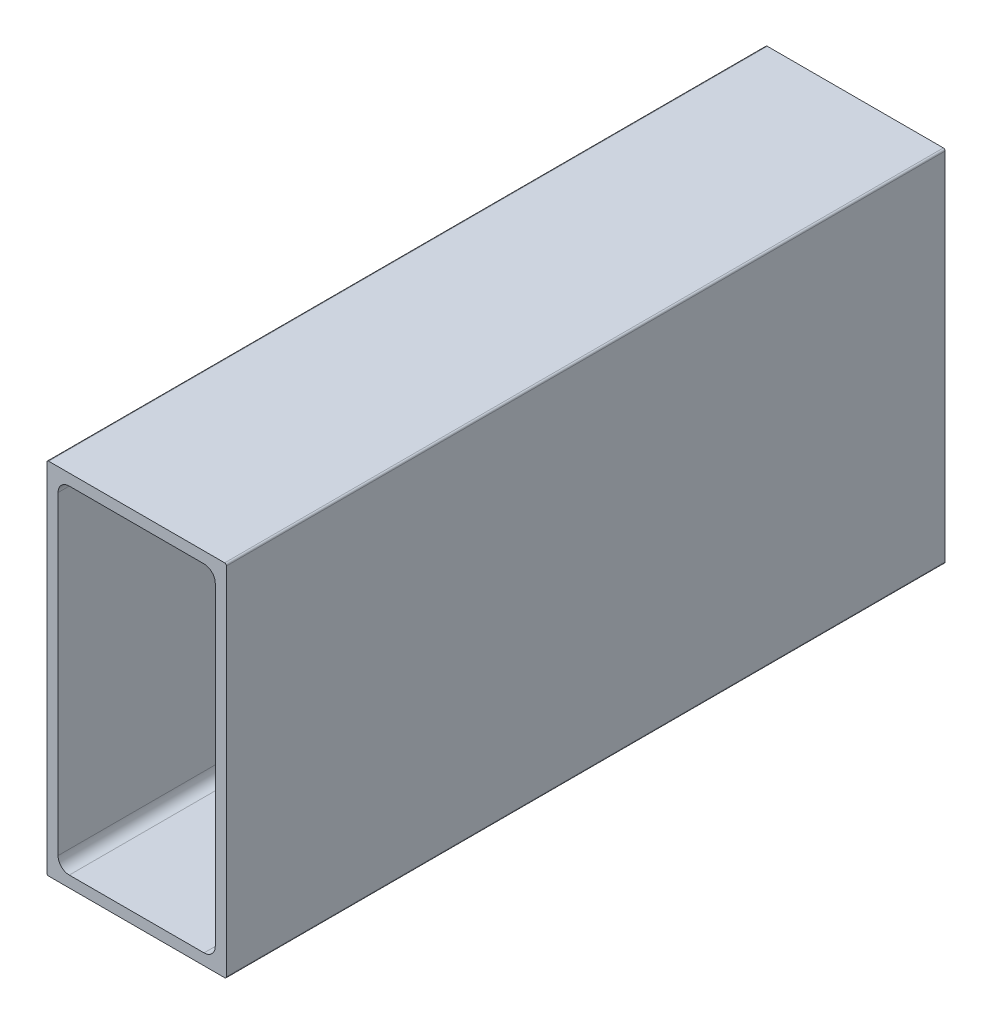
ISO-10303-21;
HEADER;
FILE_DESCRIPTION(('STEP AP214'),'2;1');
FILE_NAME('part.step','',(''),(''),'','','');
FILE_SCHEMA(('AUTOMOTIVE_DESIGN { 1 0 10303 214 1 1 1 1 }'));
ENDSEC;
DATA;
#1=APPLICATION_CONTEXT('core data for automotive mechanical design processes');
#2=APPLICATION_PROTOCOL_DEFINITION('international standard','automotive_design',2000,#1);
#3=PRODUCT_CONTEXT('',#1,'mechanical');
#4=PRODUCT('Part','Part','',(#3));
#5=PRODUCT_RELATED_PRODUCT_CATEGORY('part','',(#4));
#6=PRODUCT_DEFINITION_FORMATION('','',#4);
#7=PRODUCT_DEFINITION_CONTEXT('part definition',#1,'design');
#8=PRODUCT_DEFINITION('design','',#6,#7);
#9=PRODUCT_DEFINITION_SHAPE('','',#8);
#10=(LENGTH_UNIT() NAMED_UNIT(*) SI_UNIT(.MILLI.,.METRE.));
#11=(NAMED_UNIT(*) PLANE_ANGLE_UNIT() SI_UNIT($,.RADIAN.));
#12=(NAMED_UNIT(*) SI_UNIT($,.STERADIAN.) SOLID_ANGLE_UNIT());
#13=UNCERTAINTY_MEASURE_WITH_UNIT(LENGTH_MEASURE(1.E-05),#10,'distance_accuracy_value','');
#14=(GEOMETRIC_REPRESENTATION_CONTEXT(3) GLOBAL_UNCERTAINTY_ASSIGNED_CONTEXT((#13)) GLOBAL_UNIT_ASSIGNED_CONTEXT((#10,
#11,#12)) REPRESENTATION_CONTEXT('',''));
#15=CARTESIAN_POINT('',(0.,0.,0.));
#16=DIRECTION('',(0.,0.,1.));
#17=DIRECTION('',(1.,0.,0.));
#18=AXIS2_PLACEMENT_3D('',#15,#16,#17);
#19=CARTESIAN_POINT('',(12.446,25.146,101.6));
#20=DIRECTION('',(0.,0.,-1.));
#21=DIRECTION('',(-1.,0.,0.));
#22=AXIS2_PLACEMENT_3D('',#19,#20,#21);
#23=CYLINDRICAL_SURFACE('',#22,0.253999999999998);
#24=CARTESIAN_POINT('',(12.446,25.146,0.));
#25=DIRECTION('',(0.,0.,-1.));
#26=DIRECTION('',(-1.,0.,0.));
#27=AXIS2_PLACEMENT_3D('',#24,#25,#26);
#28=CIRCLE('',#27,0.253999999999998);
#29=CARTESIAN_POINT('',(12.446,25.4,0.));
#30=VERTEX_POINT('',#29);
#31=CARTESIAN_POINT('',(12.7,25.146,0.));
#32=VERTEX_POINT('',#31);
#33=EDGE_CURVE('E228',#30,#32,#28,.T.);
#34=ORIENTED_EDGE('',*,*,#33,.F.);
#35=DIRECTION('',(0.,0.,-1.));
#36=VECTOR('',#35,1.);
#37=CARTESIAN_POINT('',(12.446,25.4,101.6));
#38=LINE('',#37,#36);
#39=CARTESIAN_POINT('',(12.446,25.4,101.6));
#40=VERTEX_POINT('',#39);
#41=EDGE_CURVE('E11',#40,#30,#38,.T.);
#42=ORIENTED_EDGE('',*,*,#41,.F.);
#43=CARTESIAN_POINT('',(12.446,25.146,101.6));
#44=DIRECTION('',(0.,0.,-1.));
#45=DIRECTION('',(-1.,0.,0.));
#46=AXIS2_PLACEMENT_3D('',#43,#44,#45);
#47=CIRCLE('',#46,0.253999999999998);
#48=CARTESIAN_POINT('',(12.7,25.146,101.6));
#49=VERTEX_POINT('',#48);
#50=EDGE_CURVE('E246',#40,#49,#47,.T.);
#51=ORIENTED_EDGE('',*,*,#50,.T.);
#52=DIRECTION('',(0.,0.,-1.));
#53=VECTOR('',#52,1.);
#54=CARTESIAN_POINT('',(12.7,25.146,101.6));
#55=LINE('',#54,#53);
#56=EDGE_CURVE('E42',#49,#32,#55,.T.);
#57=ORIENTED_EDGE('',*,*,#56,.T.);
#58=EDGE_LOOP('',(#34,#42,#51,#57));
#59=FACE_BOUND('',#58,.T.);
#60=ADVANCED_FACE('F39',(#59),#23,.T.);
#61=CARTESIAN_POINT('',(-12.446,25.4,101.6));
#62=DIRECTION('',(0.,1.,0.));
#63=DIRECTION('',(0.,0.,1.));
#64=AXIS2_PLACEMENT_3D('',#61,#62,#63);
#65=PLANE('',#64);
#66=DIRECTION('',(1.,0.,0.));
#67=VECTOR('',#66,1.);
#68=CARTESIAN_POINT('',(-12.446,25.4,0.));
#69=LINE('',#68,#67);
#70=CARTESIAN_POINT('',(-12.446,25.4,0.));
#71=VERTEX_POINT('',#70);
#72=EDGE_CURVE('E251',#71,#30,#69,.T.);
#73=ORIENTED_EDGE('',*,*,#72,.F.);
#74=DIRECTION('',(0.,0.,-1.));
#75=VECTOR('',#74,1.);
#76=CARTESIAN_POINT('',(-12.446,25.4,101.6));
#77=LINE('',#76,#75);
#78=CARTESIAN_POINT('',(-12.446,25.4,101.6));
#79=VERTEX_POINT('',#78);
#80=EDGE_CURVE('E48',#79,#71,#77,.T.);
#81=ORIENTED_EDGE('',*,*,#80,.F.);
#82=DIRECTION('',(1.,0.,0.));
#83=VECTOR('',#82,1.);
#84=CARTESIAN_POINT('',(-12.446,25.4,101.6));
#85=LINE('',#84,#83);
#86=EDGE_CURVE('E275',#79,#40,#85,.T.);
#87=ORIENTED_EDGE('',*,*,#86,.T.);
#88=ORIENTED_EDGE('',*,*,#41,.T.);
#89=EDGE_LOOP('',(#73,#81,#87,#88));
#90=FACE_BOUND('',#89,.T.);
#91=ADVANCED_FACE('F338',(#90),#65,.T.);
#92=CARTESIAN_POINT('',(-12.446,25.146,101.6));
#93=DIRECTION('',(0.,0.,-1.));
#94=DIRECTION('',(-1.,0.,0.));
#95=AXIS2_PLACEMENT_3D('',#92,#93,#94);
#96=CYLINDRICAL_SURFACE('',#95,0.253999999999998);
#97=CARTESIAN_POINT('',(-12.446,25.146,0.));
#98=DIRECTION('',(0.,0.,-1.));
#99=DIRECTION('',(-1.,0.,0.));
#100=AXIS2_PLACEMENT_3D('',#97,#98,#99);
#101=CIRCLE('',#100,0.253999999999998);
#102=CARTESIAN_POINT('',(-12.7,25.146,0.));
#103=VERTEX_POINT('',#102);
#104=EDGE_CURVE('E302',#103,#71,#101,.T.);
#105=ORIENTED_EDGE('',*,*,#104,.F.);
#106=DIRECTION('',(0.,0.,-1.));
#107=VECTOR('',#106,1.);
#108=CARTESIAN_POINT('',(-12.7,25.146,101.6));
#109=LINE('',#108,#107);
#110=CARTESIAN_POINT('',(-12.7,25.146,101.6));
#111=VERTEX_POINT('',#110);
#112=EDGE_CURVE('E311',#111,#103,#109,.T.);
#113=ORIENTED_EDGE('',*,*,#112,.F.);
#114=CARTESIAN_POINT('',(-12.446,25.146,101.6));
#115=DIRECTION('',(0.,0.,-1.));
#116=DIRECTION('',(-1.,0.,0.));
#117=AXIS2_PLACEMENT_3D('',#114,#115,#116);
#118=CIRCLE('',#117,0.253999999999998);
#119=EDGE_CURVE('E271',#111,#79,#118,.T.);
#120=ORIENTED_EDGE('',*,*,#119,.T.);
#121=ORIENTED_EDGE('',*,*,#80,.T.);
#122=EDGE_LOOP('',(#105,#113,#120,#121));
#123=FACE_BOUND('',#122,.T.);
#124=ADVANCED_FACE('F357',(#123),#96,.T.);
#125=CARTESIAN_POINT('',(-12.7,-25.146,101.6));
#126=DIRECTION('',(-1.,0.,0.));
#127=DIRECTION('',(0.,0.,1.));
#128=AXIS2_PLACEMENT_3D('',#125,#126,#127);
#129=PLANE('',#128);
#130=DIRECTION('',(0.,1.,0.));
#131=VECTOR('',#130,1.);
#132=CARTESIAN_POINT('',(-12.7,-25.146,0.));
#133=LINE('',#132,#131);
#134=CARTESIAN_POINT('',(-12.7,-25.146,0.));
#135=VERTEX_POINT('',#134);
#136=EDGE_CURVE('E298',#135,#103,#133,.T.);
#137=ORIENTED_EDGE('',*,*,#136,.F.);
#138=DIRECTION('',(0.,0.,-1.));
#139=VECTOR('',#138,1.);
#140=CARTESIAN_POINT('',(-12.7,-25.146,101.6));
#141=LINE('',#140,#139);
#142=CARTESIAN_POINT('',(-12.7,-25.146,101.6));
#143=VERTEX_POINT('',#142);
#144=EDGE_CURVE('E314',#143,#135,#141,.T.);
#145=ORIENTED_EDGE('',*,*,#144,.F.);
#146=DIRECTION('',(0.,1.,0.));
#147=VECTOR('',#146,1.);
#148=CARTESIAN_POINT('',(-12.7,-25.146,101.6));
#149=LINE('',#148,#147);
#150=EDGE_CURVE('E267',#143,#111,#149,.T.);
#151=ORIENTED_EDGE('',*,*,#150,.T.);
#152=ORIENTED_EDGE('',*,*,#112,.T.);
#153=EDGE_LOOP('',(#137,#145,#151,#152));
#154=FACE_BOUND('',#153,.T.);
#155=ADVANCED_FACE('F355',(#154),#129,.T.);
#156=CARTESIAN_POINT('',(-12.446,-25.146,101.6));
#157=DIRECTION('',(0.,0.,-1.));
#158=DIRECTION('',(-1.,0.,0.));
#159=AXIS2_PLACEMENT_3D('',#156,#157,#158);
#160=CYLINDRICAL_SURFACE('',#159,0.253999999999998);
#161=CARTESIAN_POINT('',(-12.446,-25.146,0.));
#162=DIRECTION('',(0.,0.,-1.));
#163=DIRECTION('',(-1.,0.,0.));
#164=AXIS2_PLACEMENT_3D('',#161,#162,#163);
#165=CIRCLE('',#164,0.253999999999998);
#166=CARTESIAN_POINT('',(-12.446,-25.4,0.));
#167=VERTEX_POINT('',#166);
#168=EDGE_CURVE('E294',#167,#135,#165,.T.);
#169=ORIENTED_EDGE('',*,*,#168,.F.);
#170=DIRECTION('',(0.,0.,-1.));
#171=VECTOR('',#170,1.);
#172=CARTESIAN_POINT('',(-12.446,-25.4,101.6));
#173=LINE('',#172,#171);
#174=CARTESIAN_POINT('',(-12.446,-25.4,101.6));
#175=VERTEX_POINT('',#174);
#176=EDGE_CURVE('E317',#175,#167,#173,.T.);
#177=ORIENTED_EDGE('',*,*,#176,.F.);
#178=CARTESIAN_POINT('',(-12.446,-25.146,101.6));
#179=DIRECTION('',(0.,0.,-1.));
#180=DIRECTION('',(-1.,0.,0.));
#181=AXIS2_PLACEMENT_3D('',#178,#179,#180);
#182=CIRCLE('',#181,0.253999999999998);
#183=EDGE_CURVE('E263',#175,#143,#182,.T.);
#184=ORIENTED_EDGE('',*,*,#183,.T.);
#185=ORIENTED_EDGE('',*,*,#144,.T.);
#186=EDGE_LOOP('',(#169,#177,#184,#185));
#187=FACE_BOUND('',#186,.T.);
#188=ADVANCED_FACE('F351',(#187),#160,.T.);
#189=CARTESIAN_POINT('',(12.446,-25.4,101.6));
#190=DIRECTION('',(0.,-1.,0.));
#191=DIRECTION('',(0.,0.,-1.));
#192=AXIS2_PLACEMENT_3D('',#189,#190,#191);
#193=PLANE('',#192);
#194=DIRECTION('',(-1.,0.,0.));
#195=VECTOR('',#194,1.);
#196=CARTESIAN_POINT('',(12.446,-25.4,0.));
#197=LINE('',#196,#195);
#198=CARTESIAN_POINT('',(12.446,-25.4,0.));
#199=VERTEX_POINT('',#198);
#200=EDGE_CURVE('E290',#199,#167,#197,.T.);
#201=ORIENTED_EDGE('',*,*,#200,.F.);
#202=DIRECTION('',(0.,0.,-1.));
#203=VECTOR('',#202,1.);
#204=CARTESIAN_POINT('',(12.446,-25.4,101.6));
#205=LINE('',#204,#203);
#206=CARTESIAN_POINT('',(12.446,-25.4,101.6));
#207=VERTEX_POINT('',#206);
#208=EDGE_CURVE('E320',#207,#199,#205,.T.);
#209=ORIENTED_EDGE('',*,*,#208,.F.);
#210=DIRECTION('',(-1.,0.,0.));
#211=VECTOR('',#210,1.);
#212=CARTESIAN_POINT('',(12.446,-25.4,101.6));
#213=LINE('',#212,#211);
#214=EDGE_CURVE('E259',#207,#175,#213,.T.);
#215=ORIENTED_EDGE('',*,*,#214,.T.);
#216=ORIENTED_EDGE('',*,*,#176,.T.);
#217=EDGE_LOOP('',(#201,#209,#215,#216));
#218=FACE_BOUND('',#217,.T.);
#219=ADVANCED_FACE('F349',(#218),#193,.T.);
#220=CARTESIAN_POINT('',(12.446,-25.146,101.6));
#221=DIRECTION('',(0.,0.,-1.));
#222=DIRECTION('',(-1.,0.,0.));
#223=AXIS2_PLACEMENT_3D('',#220,#221,#222);
#224=CYLINDRICAL_SURFACE('',#223,0.253999999999998);
#225=CARTESIAN_POINT('',(12.446,-25.146,0.));
#226=DIRECTION('',(0.,0.,-1.));
#227=DIRECTION('',(-1.,0.,0.));
#228=AXIS2_PLACEMENT_3D('',#225,#226,#227);
#229=CIRCLE('',#228,0.253999999999998);
#230=CARTESIAN_POINT('',(12.7,-25.146,0.));
#231=VERTEX_POINT('',#230);
#232=EDGE_CURVE('E286',#231,#199,#229,.T.);
#233=ORIENTED_EDGE('',*,*,#232,.F.);
#234=DIRECTION('',(0.,0.,-1.));
#235=VECTOR('',#234,1.);
#236=CARTESIAN_POINT('',(12.7,-25.146,101.6));
#237=LINE('',#236,#235);
#238=CARTESIAN_POINT('',(12.7,-25.146,101.6));
#239=VERTEX_POINT('',#238);
#240=EDGE_CURVE('E322',#239,#231,#237,.T.);
#241=ORIENTED_EDGE('',*,*,#240,.F.);
#242=CARTESIAN_POINT('',(12.446,-25.146,101.6));
#243=DIRECTION('',(0.,0.,-1.));
#244=DIRECTION('',(-1.,0.,0.));
#245=AXIS2_PLACEMENT_3D('',#242,#243,#244);
#246=CIRCLE('',#245,0.253999999999998);
#247=EDGE_CURVE('E255',#239,#207,#246,.T.);
#248=ORIENTED_EDGE('',*,*,#247,.T.);
#249=ORIENTED_EDGE('',*,*,#208,.T.);
#250=EDGE_LOOP('',(#233,#241,#248,#249));
#251=FACE_BOUND('',#250,.T.);
#252=ADVANCED_FACE('F345',(#251),#224,.T.);
#253=CARTESIAN_POINT('',(12.7,25.146,101.6));
#254=DIRECTION('',(1.,0.,0.));
#255=DIRECTION('',(0.,0.,-1.));
#256=AXIS2_PLACEMENT_3D('',#253,#254,#255);
#257=PLANE('',#256);
#258=DIRECTION('',(0.,-1.,0.));
#259=VECTOR('',#258,1.);
#260=CARTESIAN_POINT('',(12.7,25.146,0.));
#261=LINE('',#260,#259);
#262=EDGE_CURVE('E282',#32,#231,#261,.T.);
#263=ORIENTED_EDGE('',*,*,#262,.F.);
#264=ORIENTED_EDGE('',*,*,#56,.F.);
#265=DIRECTION('',(0.,-1.,0.));
#266=VECTOR('',#265,1.);
#267=CARTESIAN_POINT('',(12.7,25.146,101.6));
#268=LINE('',#267,#266);
#269=EDGE_CURVE('E250',#49,#239,#268,.T.);
#270=ORIENTED_EDGE('',*,*,#269,.T.);
#271=ORIENTED_EDGE('',*,*,#240,.T.);
#272=EDGE_LOOP('',(#263,#264,#270,#271));
#273=FACE_BOUND('',#272,.T.);
#274=ADVANCED_FACE('F332',(#273),#257,.T.);
#275=CARTESIAN_POINT('',(12.446,25.146,101.6));
#276=DIRECTION('',(0.,0.,-1.));
#277=DIRECTION('',(-1.,0.,0.));
#278=AXIS2_PLACEMENT_3D('',#275,#276,#277);
#279=PLANE('',#278);
#280=DIRECTION('',(0.,-1.,0.));
#281=VECTOR('',#280,1.);
#282=CARTESIAN_POINT('',(11.1125,-22.225,101.6));
#283=LINE('',#282,#281);
#284=CARTESIAN_POINT('',(11.1125,22.225,101.6));
#285=VERTEX_POINT('',#284);
#286=CARTESIAN_POINT('',(11.1125,-22.225,101.6));
#287=VERTEX_POINT('',#286);
#288=EDGE_CURVE('E162',#285,#287,#283,.T.);
#289=ORIENTED_EDGE('',*,*,#288,.T.);
#290=CARTESIAN_POINT('',(9.525,-22.225,101.6));
#291=DIRECTION('',(0.,0.,-1.));
#292=DIRECTION('',(1.,0.,0.));
#293=AXIS2_PLACEMENT_3D('',#290,#291,#292);
#294=CIRCLE('',#293,1.5875);
#295=CARTESIAN_POINT('',(9.525,-23.8125,101.6));
#296=VERTEX_POINT('',#295);
#297=EDGE_CURVE('E155',#287,#296,#294,.T.);
#298=ORIENTED_EDGE('',*,*,#297,.T.);
#299=DIRECTION('',(-1.,0.,0.));
#300=VECTOR('',#299,1.);
#301=CARTESIAN_POINT('',(-9.525,-23.8125,101.6));
#302=LINE('',#301,#300);
#303=CARTESIAN_POINT('',(-9.525,-23.8125,101.6));
#304=VERTEX_POINT('',#303);
#305=EDGE_CURVE('E165',#296,#304,#302,.T.);
#306=ORIENTED_EDGE('',*,*,#305,.T.);
#307=CARTESIAN_POINT('',(-9.525,-22.225,101.6));
#308=DIRECTION('',(0.,0.,-1.));
#309=DIRECTION('',(1.,0.,0.));
#310=AXIS2_PLACEMENT_3D('',#307,#308,#309);
#311=CIRCLE('',#310,1.5875);
#312=CARTESIAN_POINT('',(-11.1125,-22.225,101.6));
#313=VERTEX_POINT('',#312);
#314=EDGE_CURVE('E56',#304,#313,#311,.T.);
#315=ORIENTED_EDGE('',*,*,#314,.T.);
#316=DIRECTION('',(0.,1.,0.));
#317=VECTOR('',#316,1.);
#318=CARTESIAN_POINT('',(-11.1125,22.225,101.6));
#319=LINE('',#318,#317);
#320=CARTESIAN_POINT('',(-11.1125,22.225,101.6));
#321=VERTEX_POINT('',#320);
#322=EDGE_CURVE('E184',#313,#321,#319,.T.);
#323=ORIENTED_EDGE('',*,*,#322,.T.);
#324=CARTESIAN_POINT('',(-9.525,22.225,101.6));
#325=DIRECTION('',(0.,0.,-1.));
#326=DIRECTION('',(1.,0.,0.));
#327=AXIS2_PLACEMENT_3D('',#324,#325,#326);
#328=CIRCLE('',#327,1.5875);
#329=CARTESIAN_POINT('',(-9.525,23.8125,101.6));
#330=VERTEX_POINT('',#329);
#331=EDGE_CURVE('E188',#321,#330,#328,.T.);
#332=ORIENTED_EDGE('',*,*,#331,.T.);
#333=DIRECTION('',(1.,0.,0.));
#334=VECTOR('',#333,1.);
#335=CARTESIAN_POINT('',(9.525,23.8125,101.6));
#336=LINE('',#335,#334);
#337=CARTESIAN_POINT('',(9.525,23.8125,101.6));
#338=VERTEX_POINT('',#337);
#339=EDGE_CURVE('E192',#330,#338,#336,.T.);
#340=ORIENTED_EDGE('',*,*,#339,.T.);
#341=CARTESIAN_POINT('',(9.525,22.225,101.6));
#342=DIRECTION('',(0.,0.,-1.));
#343=DIRECTION('',(1.,0.,0.));
#344=AXIS2_PLACEMENT_3D('',#341,#342,#343);
#345=CIRCLE('',#344,1.5875);
#346=EDGE_CURVE('E196',#338,#285,#345,.T.);
#347=ORIENTED_EDGE('',*,*,#346,.T.);
#348=EDGE_LOOP('',(#289,#298,#306,#315,#323,#332,#340,#347));
#349=FACE_BOUND('',#348,.T.);
#350=ORIENTED_EDGE('',*,*,#50,.F.);
#351=ORIENTED_EDGE('',*,*,#86,.F.);
#352=ORIENTED_EDGE('',*,*,#119,.F.);
#353=ORIENTED_EDGE('',*,*,#150,.F.);
#354=ORIENTED_EDGE('',*,*,#183,.F.);
#355=ORIENTED_EDGE('',*,*,#214,.F.);
#356=ORIENTED_EDGE('',*,*,#247,.F.);
#357=ORIENTED_EDGE('',*,*,#269,.F.);
#358=EDGE_LOOP('',(#350,#351,#352,#353,#354,#355,#356,#357));
#359=FACE_BOUND('',#358,.T.);
#360=ADVANCED_FACE('F170',(#349,#359),#279,.F.);
#361=CARTESIAN_POINT('',(12.446,25.146,0.));
#362=DIRECTION('',(0.,0.,-1.));
#363=DIRECTION('',(-1.,0.,0.));
#364=AXIS2_PLACEMENT_3D('',#361,#362,#363);
#365=PLANE('',#364);
#366=CARTESIAN_POINT('',(9.525,-22.225,0.));
#367=DIRECTION('',(0.,0.,-1.));
#368=DIRECTION('',(1.,0.,0.));
#369=AXIS2_PLACEMENT_3D('',#366,#367,#368);
#370=CIRCLE('',#369,1.5875);
#371=CARTESIAN_POINT('',(11.1125,-22.225,0.));
#372=VERTEX_POINT('',#371);
#373=CARTESIAN_POINT('',(9.525,-23.8125,0.));
#374=VERTEX_POINT('',#373);
#375=EDGE_CURVE('E64',#372,#374,#370,.T.);
#376=ORIENTED_EDGE('',*,*,#375,.F.);
#377=DIRECTION('',(0.,-1.,0.));
#378=VECTOR('',#377,1.);
#379=CARTESIAN_POINT('',(11.1125,-22.225,0.));
#380=LINE('',#379,#378);
#381=CARTESIAN_POINT('',(11.1125,22.225,0.));
#382=VERTEX_POINT('',#381);
#383=EDGE_CURVE('E175',#382,#372,#380,.T.);
#384=ORIENTED_EDGE('',*,*,#383,.F.);
#385=CARTESIAN_POINT('',(9.525,22.225,0.));
#386=DIRECTION('',(0.,0.,-1.));
#387=DIRECTION('',(1.,0.,0.));
#388=AXIS2_PLACEMENT_3D('',#385,#386,#387);
#389=CIRCLE('',#388,1.5875);
#390=CARTESIAN_POINT('',(9.525,23.8125,0.));
#391=VERTEX_POINT('',#390);
#392=EDGE_CURVE('E179',#391,#382,#389,.T.);
#393=ORIENTED_EDGE('',*,*,#392,.F.);
#394=DIRECTION('',(1.,0.,0.));
#395=VECTOR('',#394,1.);
#396=CARTESIAN_POINT('',(9.525,23.8125,0.));
#397=LINE('',#396,#395);
#398=CARTESIAN_POINT('',(-9.525,23.8125,0.));
#399=VERTEX_POINT('',#398);
#400=EDGE_CURVE('E218',#399,#391,#397,.T.);
#401=ORIENTED_EDGE('',*,*,#400,.F.);
#402=CARTESIAN_POINT('',(-9.525,22.225,0.));
#403=DIRECTION('',(0.,0.,-1.));
#404=DIRECTION('',(1.,0.,0.));
#405=AXIS2_PLACEMENT_3D('',#402,#403,#404);
#406=CIRCLE('',#405,1.5875);
#407=CARTESIAN_POINT('',(-11.1125,22.225,0.));
#408=VERTEX_POINT('',#407);
#409=EDGE_CURVE('E214',#408,#399,#406,.T.);
#410=ORIENTED_EDGE('',*,*,#409,.F.);
#411=DIRECTION('',(0.,1.,0.));
#412=VECTOR('',#411,1.);
#413=CARTESIAN_POINT('',(-11.1125,22.225,0.));
#414=LINE('',#413,#412);
#415=CARTESIAN_POINT('',(-11.1125,-22.225,0.));
#416=VERTEX_POINT('',#415);
#417=EDGE_CURVE('E210',#416,#408,#414,.T.);
#418=ORIENTED_EDGE('',*,*,#417,.F.);
#419=CARTESIAN_POINT('',(-9.525,-22.225,0.));
#420=DIRECTION('',(0.,0.,-1.));
#421=DIRECTION('',(1.,0.,0.));
#422=AXIS2_PLACEMENT_3D('',#419,#420,#421);
#423=CIRCLE('',#422,1.5875);
#424=CARTESIAN_POINT('',(-9.525,-23.8125,0.));
#425=VERTEX_POINT('',#424);
#426=EDGE_CURVE('E206',#425,#416,#423,.T.);
#427=ORIENTED_EDGE('',*,*,#426,.F.);
#428=DIRECTION('',(-1.,0.,0.));
#429=VECTOR('',#428,1.);
#430=CARTESIAN_POINT('',(-9.525,-23.8125,0.));
#431=LINE('',#430,#429);
#432=EDGE_CURVE('E203',#374,#425,#431,.T.);
#433=ORIENTED_EDGE('',*,*,#432,.F.);
#434=EDGE_LOOP('',(#376,#384,#393,#401,#410,#418,#427,#433));
#435=FACE_BOUND('',#434,.T.);
#436=ORIENTED_EDGE('',*,*,#33,.T.);
#437=ORIENTED_EDGE('',*,*,#262,.T.);
#438=ORIENTED_EDGE('',*,*,#232,.T.);
#439=ORIENTED_EDGE('',*,*,#200,.T.);
#440=ORIENTED_EDGE('',*,*,#168,.T.);
#441=ORIENTED_EDGE('',*,*,#136,.T.);
#442=ORIENTED_EDGE('',*,*,#104,.T.);
#443=ORIENTED_EDGE('',*,*,#72,.T.);
#444=EDGE_LOOP('',(#436,#437,#438,#439,#440,#441,#442,#443));
#445=FACE_BOUND('',#444,.T.);
#446=ADVANCED_FACE('F334',(#435,#445),#365,.T.);
#447=CARTESIAN_POINT('',(9.525,-22.225,101.6));
#448=DIRECTION('',(0.,0.,-1.));
#449=DIRECTION('',(-1.,0.,0.));
#450=AXIS2_PLACEMENT_3D('',#447,#448,#449);
#451=CYLINDRICAL_SURFACE('',#450,1.5875);
#452=ORIENTED_EDGE('',*,*,#375,.T.);
#453=DIRECTION('',(0.,0.,-1.));
#454=VECTOR('',#453,1.);
#455=CARTESIAN_POINT('',(9.525,-23.8125,101.6));
#456=LINE('',#455,#454);
#457=EDGE_CURVE('E151',#296,#374,#456,.T.);
#458=ORIENTED_EDGE('',*,*,#457,.F.);
#459=ORIENTED_EDGE('',*,*,#297,.F.);
#460=DIRECTION('',(0.,0.,-1.));
#461=VECTOR('',#460,1.);
#462=CARTESIAN_POINT('',(11.1125,-22.225,101.6));
#463=LINE('',#462,#461);
#464=EDGE_CURVE('E225',#287,#372,#463,.T.);
#465=ORIENTED_EDGE('',*,*,#464,.T.);
#466=EDGE_LOOP('',(#452,#458,#459,#465));
#467=FACE_BOUND('',#466,.T.);
#468=ADVANCED_FACE('F153',(#467),#451,.F.);
#469=CARTESIAN_POINT('',(11.1125,-22.225,101.6));
#470=DIRECTION('',(1.,0.,0.));
#471=DIRECTION('',(0.,0.,-1.));
#472=AXIS2_PLACEMENT_3D('',#469,#470,#471);
#473=PLANE('',#472);
#474=ORIENTED_EDGE('',*,*,#383,.T.);
#475=ORIENTED_EDGE('',*,*,#464,.F.);
#476=ORIENTED_EDGE('',*,*,#288,.F.);
#477=DIRECTION('',(0.,0.,-1.));
#478=VECTOR('',#477,1.);
#479=CARTESIAN_POINT('',(11.1125,22.225,101.6));
#480=LINE('',#479,#478);
#481=EDGE_CURVE('E229',#285,#382,#480,.T.);
#482=ORIENTED_EDGE('',*,*,#481,.T.);
#483=EDGE_LOOP('',(#474,#475,#476,#482));
#484=FACE_BOUND('',#483,.T.);
#485=ADVANCED_FACE('F440',(#484),#473,.F.);
#486=CARTESIAN_POINT('',(9.525,22.225,101.6));
#487=DIRECTION('',(0.,0.,-1.));
#488=DIRECTION('',(-1.,0.,0.));
#489=AXIS2_PLACEMENT_3D('',#486,#487,#488);
#490=CYLINDRICAL_SURFACE('',#489,1.5875);
#491=ORIENTED_EDGE('',*,*,#392,.T.);
#492=ORIENTED_EDGE('',*,*,#481,.F.);
#493=ORIENTED_EDGE('',*,*,#346,.F.);
#494=DIRECTION('',(0.,0.,-1.));
#495=VECTOR('',#494,1.);
#496=CARTESIAN_POINT('',(9.525,23.8125,101.6));
#497=LINE('',#496,#495);
#498=EDGE_CURVE('E232',#338,#391,#497,.T.);
#499=ORIENTED_EDGE('',*,*,#498,.T.);
#500=EDGE_LOOP('',(#491,#492,#493,#499));
#501=FACE_BOUND('',#500,.T.);
#502=ADVANCED_FACE('F449',(#501),#490,.F.);
#503=CARTESIAN_POINT('',(9.525,23.8125,101.6));
#504=DIRECTION('',(0.,1.,0.));
#505=DIRECTION('',(0.,0.,1.));
#506=AXIS2_PLACEMENT_3D('',#503,#504,#505);
#507=PLANE('',#506);
#508=ORIENTED_EDGE('',*,*,#400,.T.);
#509=ORIENTED_EDGE('',*,*,#498,.F.);
#510=ORIENTED_EDGE('',*,*,#339,.F.);
#511=DIRECTION('',(0.,0.,-1.));
#512=VECTOR('',#511,1.);
#513=CARTESIAN_POINT('',(-9.525,23.8125,101.6));
#514=LINE('',#513,#512);
#515=EDGE_CURVE('E235',#330,#399,#514,.T.);
#516=ORIENTED_EDGE('',*,*,#515,.T.);
#517=EDGE_LOOP('',(#508,#509,#510,#516));
#518=FACE_BOUND('',#517,.T.);
#519=ADVANCED_FACE('F459',(#518),#507,.F.);
#520=CARTESIAN_POINT('',(-9.525,22.225,101.6));
#521=DIRECTION('',(0.,0.,-1.));
#522=DIRECTION('',(-1.,0.,0.));
#523=AXIS2_PLACEMENT_3D('',#520,#521,#522);
#524=CYLINDRICAL_SURFACE('',#523,1.5875);
#525=ORIENTED_EDGE('',*,*,#409,.T.);
#526=ORIENTED_EDGE('',*,*,#515,.F.);
#527=ORIENTED_EDGE('',*,*,#331,.F.);
#528=DIRECTION('',(0.,0.,-1.));
#529=VECTOR('',#528,1.);
#530=CARTESIAN_POINT('',(-11.1125,22.225,101.6));
#531=LINE('',#530,#529);
#532=EDGE_CURVE('E238',#321,#408,#531,.T.);
#533=ORIENTED_EDGE('',*,*,#532,.T.);
#534=EDGE_LOOP('',(#525,#526,#527,#533));
#535=FACE_BOUND('',#534,.T.);
#536=ADVANCED_FACE('F469',(#535),#524,.F.);
#537=CARTESIAN_POINT('',(-11.1125,22.225,101.6));
#538=DIRECTION('',(-1.,0.,0.));
#539=DIRECTION('',(0.,0.,1.));
#540=AXIS2_PLACEMENT_3D('',#537,#538,#539);
#541=PLANE('',#540);
#542=ORIENTED_EDGE('',*,*,#417,.T.);
#543=ORIENTED_EDGE('',*,*,#532,.F.);
#544=ORIENTED_EDGE('',*,*,#322,.F.);
#545=DIRECTION('',(0.,0.,-1.));
#546=VECTOR('',#545,1.);
#547=CARTESIAN_POINT('',(-11.1125,-22.225,101.6));
#548=LINE('',#547,#546);
#549=EDGE_CURVE('E241',#313,#416,#548,.T.);
#550=ORIENTED_EDGE('',*,*,#549,.T.);
#551=EDGE_LOOP('',(#542,#543,#544,#550));
#552=FACE_BOUND('',#551,.T.);
#553=ADVANCED_FACE('F479',(#552),#541,.F.);
#554=CARTESIAN_POINT('',(-9.525,-22.225,101.6));
#555=DIRECTION('',(0.,0.,-1.));
#556=DIRECTION('',(-1.,0.,0.));
#557=AXIS2_PLACEMENT_3D('',#554,#555,#556);
#558=CYLINDRICAL_SURFACE('',#557,1.5875);
#559=ORIENTED_EDGE('',*,*,#426,.T.);
#560=ORIENTED_EDGE('',*,*,#549,.F.);
#561=ORIENTED_EDGE('',*,*,#314,.F.);
#562=DIRECTION('',(0.,0.,-1.));
#563=VECTOR('',#562,1.);
#564=CARTESIAN_POINT('',(-9.525,-23.8125,101.6));
#565=LINE('',#564,#563);
#566=EDGE_CURVE('E161',#304,#425,#565,.T.);
#567=ORIENTED_EDGE('',*,*,#566,.T.);
#568=EDGE_LOOP('',(#559,#560,#561,#567));
#569=FACE_BOUND('',#568,.T.);
#570=ADVANCED_FACE('F489',(#569),#558,.F.);
#571=CARTESIAN_POINT('',(-9.525,-23.8125,101.6));
#572=DIRECTION('',(0.,-1.,0.));
#573=DIRECTION('',(0.,0.,-1.));
#574=AXIS2_PLACEMENT_3D('',#571,#572,#573);
#575=PLANE('',#574);
#576=ORIENTED_EDGE('',*,*,#432,.T.);
#577=ORIENTED_EDGE('',*,*,#566,.F.);
#578=ORIENTED_EDGE('',*,*,#305,.F.);
#579=ORIENTED_EDGE('',*,*,#457,.T.);
#580=EDGE_LOOP('',(#576,#577,#578,#579));
#581=FACE_BOUND('',#580,.T.);
#582=ADVANCED_FACE('F166',(#581),#575,.F.);
#583=CLOSED_SHELL('',(#60,#91,#124,#155,#188,#219,#252,#274,#360,#446,#468,#485,#502,#519,#536,
#553,#570,#582));
#584=MANIFOLD_SOLID_BREP('B2',#583);
#585=ADVANCED_BREP_SHAPE_REPRESENTATION('',(#18,#584),#14);
#586=SHAPE_DEFINITION_REPRESENTATION(#9,#585);
ENDSEC;
END-ISO-10303-21;
